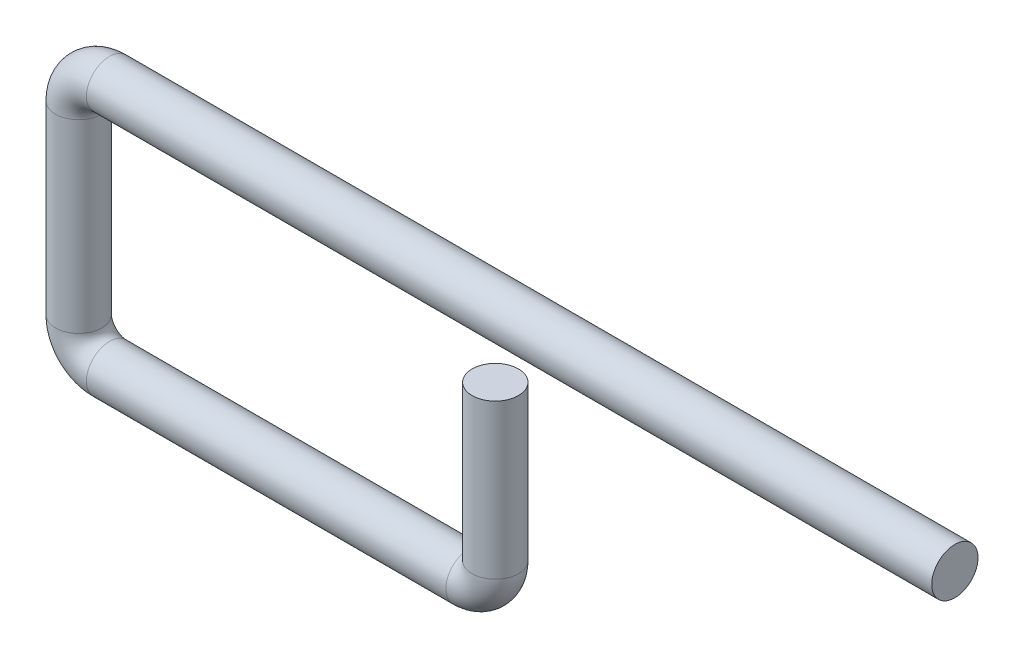
ISO-10303-21;
HEADER;
FILE_DESCRIPTION(('STEP AP214'),'2;1');
FILE_NAME('part.step','',(''),(''),'','','');
FILE_SCHEMA(('AUTOMOTIVE_DESIGN { 1 0 10303 214 1 1 1 1 }'));
ENDSEC;
DATA;
#1=APPLICATION_CONTEXT('core data for automotive mechanical design processes');
#2=APPLICATION_PROTOCOL_DEFINITION('international standard','automotive_design',2000,#1);
#3=PRODUCT_CONTEXT('',#1,'mechanical');
#4=PRODUCT('Part','Part','',(#3));
#5=PRODUCT_RELATED_PRODUCT_CATEGORY('part','',(#4));
#6=PRODUCT_DEFINITION_FORMATION('','',#4);
#7=PRODUCT_DEFINITION_CONTEXT('part definition',#1,'design');
#8=PRODUCT_DEFINITION('design','',#6,#7);
#9=PRODUCT_DEFINITION_SHAPE('','',#8);
#10=(LENGTH_UNIT() NAMED_UNIT(*) SI_UNIT(.MILLI.,.METRE.));
#11=(NAMED_UNIT(*) PLANE_ANGLE_UNIT() SI_UNIT($,.RADIAN.));
#12=(NAMED_UNIT(*) SI_UNIT($,.STERADIAN.) SOLID_ANGLE_UNIT());
#13=UNCERTAINTY_MEASURE_WITH_UNIT(LENGTH_MEASURE(1.E-05),#10,'distance_accuracy_value','');
#14=(GEOMETRIC_REPRESENTATION_CONTEXT(3) GLOBAL_UNCERTAINTY_ASSIGNED_CONTEXT((#13)) GLOBAL_UNIT_ASSIGNED_CONTEXT((#10,
#11,#12)) REPRESENTATION_CONTEXT('',''));
#15=CARTESIAN_POINT('',(0.,0.,0.));
#16=DIRECTION('',(0.,0.,1.));
#17=DIRECTION('',(1.,0.,0.));
#18=AXIS2_PLACEMENT_3D('',#15,#16,#17);
#19=CARTESIAN_POINT('',(0.,0.,0.));
#20=DIRECTION('',(1.,0.,0.));
#21=DIRECTION('',(0.,0.,-1.));
#22=AXIS2_PLACEMENT_3D('',#19,#20,#21);
#23=PLANE('',#22);
#24=CARTESIAN_POINT('',(0.,0.,0.));
#25=DIRECTION('',(1.,0.,0.));
#26=DIRECTION('',(0.,0.,-1.));
#27=AXIS2_PLACEMENT_3D('',#24,#25,#26);
#28=CIRCLE('',#27,3.75);
#29=CARTESIAN_POINT('',(0.,0.,-3.75));
#30=VERTEX_POINT('',#29);
#31=EDGE_CURVE('E67',#30,#30,#28,.T.);
#32=ORIENTED_EDGE('',*,*,#31,.T.);
#33=EDGE_LOOP('',(#32));
#34=FACE_BOUND('',#33,.T.);
#35=ADVANCED_FACE('F39',(#34),#23,.T.);
#36=CARTESIAN_POINT('',(-74.482044198895,-10.732044198895,0.));
#37=DIRECTION('',(0.,-1.,0.));
#38=DIRECTION('',(0.,0.,-1.));
#39=AXIS2_PLACEMENT_3D('',#36,#37,#38);
#40=PLANE('',#39);
#41=CARTESIAN_POINT('',(-74.482044198895,-10.732044198895,0.));
#42=DIRECTION('',(0.,-1.,0.));
#43=DIRECTION('',(0.,0.,-1.));
#44=AXIS2_PLACEMENT_3D('',#41,#42,#43);
#45=CIRCLE('',#44,3.75);
#46=CARTESIAN_POINT('',(-74.482044198895,-10.732044198895,-3.75));
#47=VERTEX_POINT('',#46);
#48=EDGE_CURVE('E10',#47,#47,#45,.T.);
#49=ORIENTED_EDGE('',*,*,#48,.F.);
#50=EDGE_LOOP('',(#49));
#51=FACE_BOUND('',#50,.T.);
#52=ADVANCED_FACE('F75',(#51),#40,.F.);
#53=CARTESIAN_POINT('',(0.,0.,0.));
#54=DIRECTION('',(-1.,0.,0.));
#55=DIRECTION('',(0.,-1.,0.));
#56=AXIS2_PLACEMENT_3D('',#53,#54,#55);
#57=CYLINDRICAL_SURFACE('',#56,3.75);
#58=CARTESIAN_POINT('',(-137.,0.,0.));
#59=DIRECTION('',(1.,0.,0.));
#60=DIRECTION('',(0.,0.,-1.));
#61=AXIS2_PLACEMENT_3D('',#58,#59,#60);
#62=CIRCLE('',#61,3.75);
#63=CARTESIAN_POINT('',(-137.,3.74999999999999,0.));
#64=VERTEX_POINT('',#63);
#65=EDGE_CURVE('E64',#64,#64,#62,.T.);
#66=ORIENTED_EDGE('',*,*,#65,.T.);
#67=EDGE_LOOP('',(#66));
#68=FACE_BOUND('',#67,.T.);
#69=ORIENTED_EDGE('',*,*,#31,.F.);
#70=EDGE_LOOP('',(#69));
#71=FACE_BOUND('',#70,.T.);
#72=ADVANCED_FACE('F72',(#68,#71),#57,.T.);
#73=CARTESIAN_POINT('',(-137.,-5.00000000000002,0.));
#74=DIRECTION('',(0.,0.,1.));
#75=DIRECTION('',(1.,0.,0.));
#76=AXIS2_PLACEMENT_3D('',#73,#74,#75);
#77=TOROIDAL_SURFACE('',#76,5.,3.75);
#78=CARTESIAN_POINT('',(-142.,-5.00000000000002,0.));
#79=DIRECTION('',(0.,1.,0.));
#80=DIRECTION('',(0.,0.,-1.));
#81=AXIS2_PLACEMENT_3D('',#78,#79,#80);
#82=CIRCLE('',#81,3.75);
#83=CARTESIAN_POINT('',(-145.75,-5.00000000000002,0.));
#84=VERTEX_POINT('',#83);
#85=EDGE_CURVE('E61',#84,#84,#82,.T.);
#86=CARTESIAN_POINT('',(-137.,-5.00000000000002,0.));
#87=DIRECTION('',(0.,0.,1.));
#88=DIRECTION('',(1.,0.,0.));
#89=AXIS2_PLACEMENT_3D('',#86,#87,#88);
#90=CIRCLE('',#89,8.75);
#91=EDGE_CURVE('',#64,#84,#90,.T.);
#92=ORIENTED_EDGE('',*,*,#65,.F.);
#93=ORIENTED_EDGE('',*,*,#85,.T.);
#94=ORIENTED_EDGE('',*,*,#91,.T.);
#95=ORIENTED_EDGE('',*,*,#91,.F.);
#96=EDGE_LOOP('',(#92,#94,#93,#95));
#97=FACE_BOUND('',#96,.T.);
#98=ADVANCED_FACE('F74',(#97),#77,.T.);
#99=CARTESIAN_POINT('',(-142.,-5.00000000000002,0.));
#100=DIRECTION('',(0.,-1.,0.));
#101=DIRECTION('',(0.,0.,-1.));
#102=AXIS2_PLACEMENT_3D('',#99,#100,#101);
#103=CYLINDRICAL_SURFACE('',#102,3.75);
#104=CARTESIAN_POINT('',(-142.,-35.,0.));
#105=DIRECTION('',(0.,1.,0.));
#106=DIRECTION('',(0.,0.,-1.));
#107=AXIS2_PLACEMENT_3D('',#104,#105,#106);
#108=CIRCLE('',#107,3.75);
#109=CARTESIAN_POINT('',(-145.75,-35.,0.));
#110=VERTEX_POINT('',#109);
#111=EDGE_CURVE('E58',#110,#110,#108,.T.);
#112=ORIENTED_EDGE('',*,*,#111,.T.);
#113=EDGE_LOOP('',(#112));
#114=FACE_BOUND('',#113,.T.);
#115=ORIENTED_EDGE('',*,*,#85,.F.);
#116=EDGE_LOOP('',(#115));
#117=FACE_BOUND('',#116,.T.);
#118=ADVANCED_FACE('F82',(#114,#117),#103,.T.);
#119=CARTESIAN_POINT('',(-137.,-35.,0.));
#120=DIRECTION('',(0.,0.,1.));
#121=DIRECTION('',(1.,0.,0.));
#122=AXIS2_PLACEMENT_3D('',#119,#120,#121);
#123=TOROIDAL_SURFACE('',#122,5.,3.75);
#124=CARTESIAN_POINT('',(-137.,-40.,0.));
#125=DIRECTION('',(-1.,0.,0.));
#126=DIRECTION('',(0.,0.,-1.));
#127=AXIS2_PLACEMENT_3D('',#124,#125,#126);
#128=CIRCLE('',#127,3.75);
#129=CARTESIAN_POINT('',(-137.,-43.75,0.));
#130=VERTEX_POINT('',#129);
#131=EDGE_CURVE('E53',#130,#130,#128,.T.);
#132=CARTESIAN_POINT('',(-137.,-35.,0.));
#133=DIRECTION('',(0.,0.,1.));
#134=DIRECTION('',(1.,0.,0.));
#135=AXIS2_PLACEMENT_3D('',#132,#133,#134);
#136=CIRCLE('',#135,8.75);
#137=EDGE_CURVE('',#110,#130,#136,.T.);
#138=ORIENTED_EDGE('',*,*,#111,.F.);
#139=ORIENTED_EDGE('',*,*,#131,.T.);
#140=ORIENTED_EDGE('',*,*,#137,.T.);
#141=ORIENTED_EDGE('',*,*,#137,.F.);
#142=EDGE_LOOP('',(#138,#140,#139,#141));
#143=FACE_BOUND('',#142,.T.);
#144=ADVANCED_FACE('F99',(#143),#123,.T.);
#145=CARTESIAN_POINT('',(-137.,-40.,0.));
#146=DIRECTION('',(1.,0.,0.));
#147=DIRECTION('',(0.,1.,0.));
#148=AXIS2_PLACEMENT_3D('',#145,#146,#147);
#149=CYLINDRICAL_SURFACE('',#148,3.75);
#150=CARTESIAN_POINT('',(-78.75,-40.,0.));
#151=DIRECTION('',(-1.,0.,0.));
#152=DIRECTION('',(0.,0.,-1.));
#153=AXIS2_PLACEMENT_3D('',#150,#151,#152);
#154=CIRCLE('',#153,3.75);
#155=CARTESIAN_POINT('',(-78.75,-43.75,0.));
#156=VERTEX_POINT('',#155);
#157=EDGE_CURVE('E49',#156,#156,#154,.T.);
#158=ORIENTED_EDGE('',*,*,#157,.T.);
#159=EDGE_LOOP('',(#158));
#160=FACE_BOUND('',#159,.T.);
#161=ORIENTED_EDGE('',*,*,#131,.F.);
#162=EDGE_LOOP('',(#161));
#163=FACE_BOUND('',#162,.T.);
#164=ADVANCED_FACE('F93',(#160,#163),#149,.T.);
#165=CARTESIAN_POINT('',(-78.75,-35.732044198895,0.));
#166=DIRECTION('',(0.,0.,1.));
#167=DIRECTION('',(1.,0.,0.));
#168=AXIS2_PLACEMENT_3D('',#165,#166,#167);
#169=TOROIDAL_SURFACE('',#168,4.26795580110497,3.75);
#170=CARTESIAN_POINT('',(-74.482044198895,-35.732044198895,0.));
#171=DIRECTION('',(0.,-1.,0.));
#172=DIRECTION('',(0.,0.,-1.));
#173=AXIS2_PLACEMENT_3D('',#170,#171,#172);
#174=CIRCLE('',#173,3.75);
#175=CARTESIAN_POINT('',(-70.7320441988951,-35.732044198895,0.));
#176=VERTEX_POINT('',#175);
#177=EDGE_CURVE('E45',#176,#176,#174,.T.);
#178=CARTESIAN_POINT('',(-78.75,-35.732044198895,0.));
#179=DIRECTION('',(0.,0.,1.));
#180=DIRECTION('',(1.,0.,0.));
#181=AXIS2_PLACEMENT_3D('',#178,#179,#180);
#182=CIRCLE('',#181,8.01795580110497);
#183=EDGE_CURVE('',#156,#176,#182,.T.);
#184=ORIENTED_EDGE('',*,*,#157,.F.);
#185=ORIENTED_EDGE('',*,*,#177,.T.);
#186=ORIENTED_EDGE('',*,*,#183,.T.);
#187=ORIENTED_EDGE('',*,*,#183,.F.);
#188=EDGE_LOOP('',(#184,#186,#185,#187));
#189=FACE_BOUND('',#188,.T.);
#190=ADVANCED_FACE('F88',(#189),#169,.T.);
#191=CARTESIAN_POINT('',(-74.482044198895,-35.732044198895,0.));
#192=DIRECTION('',(0.,1.,0.));
#193=DIRECTION('',(0.,0.,1.));
#194=AXIS2_PLACEMENT_3D('',#191,#192,#193);
#195=CYLINDRICAL_SURFACE('',#194,3.75);
#196=ORIENTED_EDGE('',*,*,#48,.T.);
#197=EDGE_LOOP('',(#196));
#198=FACE_BOUND('',#197,.T.);
#199=ORIENTED_EDGE('',*,*,#177,.F.);
#200=EDGE_LOOP('',(#199));
#201=FACE_BOUND('',#200,.T.);
#202=ADVANCED_FACE('F86',(#198,#201),#195,.T.);
#203=CLOSED_SHELL('',(#35,#52,#72,#98,#118,#144,#164,#190,#202));
#204=MANIFOLD_SOLID_BREP('B2',#203);
#205=ADVANCED_BREP_SHAPE_REPRESENTATION('',(#18,#204),#14);
#206=SHAPE_DEFINITION_REPRESENTATION(#9,#205);
ENDSEC;
END-ISO-10303-21;
